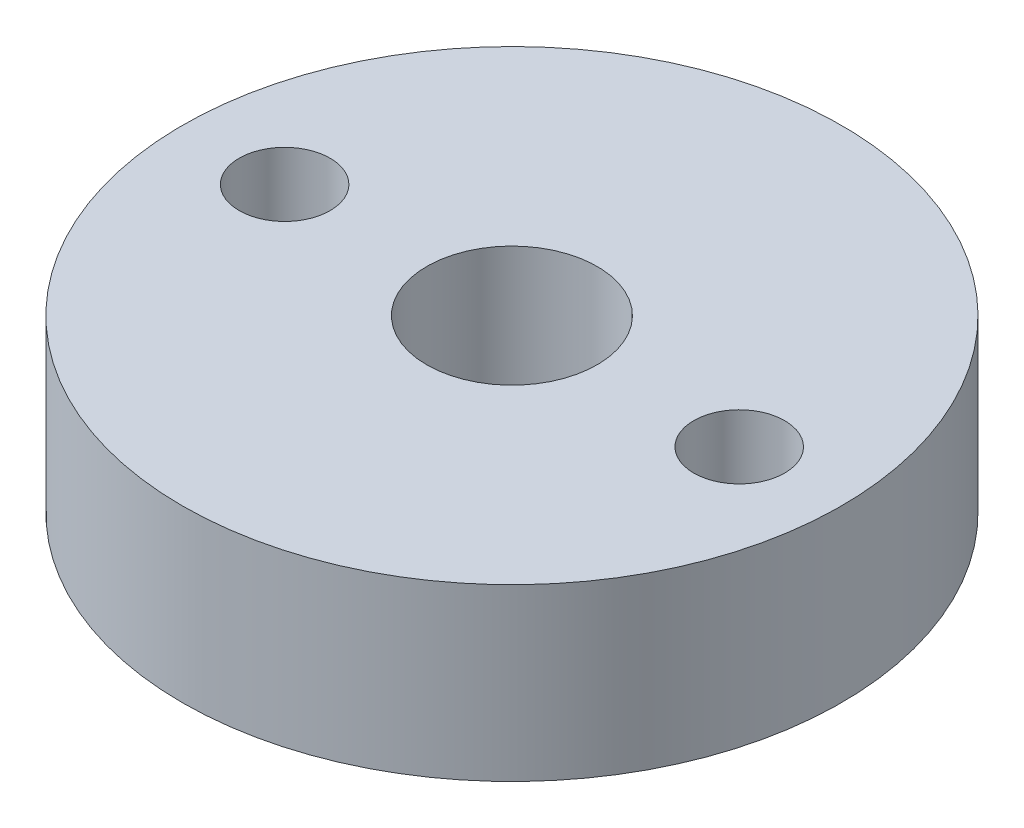
ISO-10303-21;
HEADER;
FILE_DESCRIPTION(('STEP AP214'),'2;1');
FILE_NAME('part.step','',(''),(''),'','','');
FILE_SCHEMA(('AUTOMOTIVE_DESIGN { 1 0 10303 214 1 1 1 1 }'));
ENDSEC;
DATA;
#1=APPLICATION_CONTEXT('core data for automotive mechanical design processes');
#2=APPLICATION_PROTOCOL_DEFINITION('international standard','automotive_design',2000,#1);
#3=PRODUCT_CONTEXT('',#1,'mechanical');
#4=PRODUCT('Part','Part','',(#3));
#5=PRODUCT_RELATED_PRODUCT_CATEGORY('part','',(#4));
#6=PRODUCT_DEFINITION_FORMATION('','',#4);
#7=PRODUCT_DEFINITION_CONTEXT('part definition',#1,'design');
#8=PRODUCT_DEFINITION('design','',#6,#7);
#9=PRODUCT_DEFINITION_SHAPE('','',#8);
#10=(LENGTH_UNIT() NAMED_UNIT(*) SI_UNIT(.MILLI.,.METRE.));
#11=(NAMED_UNIT(*) PLANE_ANGLE_UNIT() SI_UNIT($,.RADIAN.));
#12=(NAMED_UNIT(*) SI_UNIT($,.STERADIAN.) SOLID_ANGLE_UNIT());
#13=UNCERTAINTY_MEASURE_WITH_UNIT(LENGTH_MEASURE(1.E-05),#10,'distance_accuracy_value','');
#14=(GEOMETRIC_REPRESENTATION_CONTEXT(3) GLOBAL_UNCERTAINTY_ASSIGNED_CONTEXT((#13)) GLOBAL_UNIT_ASSIGNED_CONTEXT((#10,
#11,#12)) REPRESENTATION_CONTEXT('',''));
#15=CARTESIAN_POINT('',(0.,0.,0.));
#16=DIRECTION('',(0.,0.,1.));
#17=DIRECTION('',(1.,0.,0.));
#18=AXIS2_PLACEMENT_3D('',#15,#16,#17);
#19=CARTESIAN_POINT('',(0.,0.,0.));
#20=DIRECTION('',(0.,-1.,0.));
#21=DIRECTION('',(0.,0.,-1.));
#22=AXIS2_PLACEMENT_3D('',#19,#20,#21);
#23=CYLINDRICAL_SURFACE('',#22,11.6);
#24=CARTESIAN_POINT('',(0.,0.,0.));
#25=DIRECTION('',(0.,-1.,0.));
#26=DIRECTION('',(0.,0.,1.));
#27=AXIS2_PLACEMENT_3D('',#24,#25,#26);
#28=CIRCLE('',#27,11.6);
#29=CARTESIAN_POINT('',(0.,0.,11.6));
#30=VERTEX_POINT('',#29);
#31=EDGE_CURVE('E10',#30,#30,#28,.T.);
#32=ORIENTED_EDGE('',*,*,#31,.T.);
#33=EDGE_LOOP('',(#32));
#34=FACE_BOUND('',#33,.T.);
#35=CARTESIAN_POINT('',(0.,-6.,0.));
#36=DIRECTION('',(0.,-1.,0.));
#37=DIRECTION('',(0.,0.,1.));
#38=AXIS2_PLACEMENT_3D('',#35,#36,#37);
#39=CIRCLE('',#38,11.6);
#40=CARTESIAN_POINT('',(0.,-6.,11.6));
#41=VERTEX_POINT('',#40);
#42=EDGE_CURVE('E38',#41,#41,#39,.T.);
#43=ORIENTED_EDGE('',*,*,#42,.F.);
#44=EDGE_LOOP('',(#43));
#45=FACE_BOUND('',#44,.T.);
#46=ADVANCED_FACE('F35',(#34,#45),#23,.T.);
#47=CARTESIAN_POINT('',(0.,0.,0.));
#48=DIRECTION('',(0.,1.,0.));
#49=DIRECTION('',(0.,0.,1.));
#50=AXIS2_PLACEMENT_3D('',#47,#48,#49);
#51=PLANE('',#50);
#52=CARTESIAN_POINT('',(-8.,0.,0.));
#53=DIRECTION('',(0.,-1.,0.));
#54=DIRECTION('',(0.,0.,1.));
#55=AXIS2_PLACEMENT_3D('',#52,#53,#54);
#56=CIRCLE('',#55,1.6);
#57=CARTESIAN_POINT('',(-8.,0.,1.6));
#58=VERTEX_POINT('',#57);
#59=EDGE_CURVE('E56',#58,#58,#56,.T.);
#60=ORIENTED_EDGE('',*,*,#59,.T.);
#61=EDGE_LOOP('',(#60));
#62=FACE_BOUND('',#61,.T.);
#63=CARTESIAN_POINT('',(0.,0.,0.));
#64=DIRECTION('',(0.,-1.,0.));
#65=DIRECTION('',(0.,0.,1.));
#66=AXIS2_PLACEMENT_3D('',#63,#64,#65);
#67=CIRCLE('',#66,3.);
#68=CARTESIAN_POINT('',(0.,0.,3.));
#69=VERTEX_POINT('',#68);
#70=EDGE_CURVE('E50',#69,#69,#67,.T.);
#71=ORIENTED_EDGE('',*,*,#70,.T.);
#72=EDGE_LOOP('',(#71));
#73=FACE_BOUND('',#72,.T.);
#74=CARTESIAN_POINT('',(8.,0.,0.));
#75=DIRECTION('',(0.,-1.,0.));
#76=DIRECTION('',(0.,0.,1.));
#77=AXIS2_PLACEMENT_3D('',#74,#75,#76);
#78=CIRCLE('',#77,1.6);
#79=CARTESIAN_POINT('',(8.,0.,1.6));
#80=VERTEX_POINT('',#79);
#81=EDGE_CURVE('E45',#80,#80,#78,.T.);
#82=ORIENTED_EDGE('',*,*,#81,.T.);
#83=EDGE_LOOP('',(#82));
#84=FACE_BOUND('',#83,.T.);
#85=ORIENTED_EDGE('',*,*,#31,.F.);
#86=EDGE_LOOP('',(#85));
#87=FACE_BOUND('',#86,.T.);
#88=ADVANCED_FACE('F65',(#62,#73,#84,#87),#51,.T.);
#89=CARTESIAN_POINT('',(0.,-6.,0.));
#90=DIRECTION('',(0.,1.,0.));
#91=DIRECTION('',(0.,0.,1.));
#92=AXIS2_PLACEMENT_3D('',#89,#90,#91);
#93=PLANE('',#92);
#94=CARTESIAN_POINT('',(-8.,-6.,0.));
#95=DIRECTION('',(0.,-1.,0.));
#96=DIRECTION('',(0.,0.,1.));
#97=AXIS2_PLACEMENT_3D('',#94,#95,#96);
#98=CIRCLE('',#97,1.6);
#99=CARTESIAN_POINT('',(-8.,-6.,1.6));
#100=VERTEX_POINT('',#99);
#101=EDGE_CURVE('E59',#100,#100,#98,.T.);
#102=ORIENTED_EDGE('',*,*,#101,.F.);
#103=EDGE_LOOP('',(#102));
#104=FACE_BOUND('',#103,.T.);
#105=CARTESIAN_POINT('',(0.,-6.,0.));
#106=DIRECTION('',(0.,-1.,0.));
#107=DIRECTION('',(0.,0.,1.));
#108=AXIS2_PLACEMENT_3D('',#105,#106,#107);
#109=CIRCLE('',#108,3.);
#110=CARTESIAN_POINT('',(0.,-6.,3.));
#111=VERTEX_POINT('',#110);
#112=EDGE_CURVE('E53',#111,#111,#109,.T.);
#113=ORIENTED_EDGE('',*,*,#112,.F.);
#114=EDGE_LOOP('',(#113));
#115=FACE_BOUND('',#114,.T.);
#116=CARTESIAN_POINT('',(8.,-6.,0.));
#117=DIRECTION('',(0.,-1.,0.));
#118=DIRECTION('',(0.,0.,1.));
#119=AXIS2_PLACEMENT_3D('',#116,#117,#118);
#120=CIRCLE('',#119,1.6);
#121=CARTESIAN_POINT('',(8.,-6.,1.6));
#122=VERTEX_POINT('',#121);
#123=EDGE_CURVE('E47',#122,#122,#120,.T.);
#124=ORIENTED_EDGE('',*,*,#123,.F.);
#125=EDGE_LOOP('',(#124));
#126=FACE_BOUND('',#125,.T.);
#127=ORIENTED_EDGE('',*,*,#42,.T.);
#128=EDGE_LOOP('',(#127));
#129=FACE_BOUND('',#128,.T.);
#130=ADVANCED_FACE('F75',(#104,#115,#126,#129),#93,.F.);
#131=CARTESIAN_POINT('',(8.,0.,0.));
#132=DIRECTION('',(0.,-1.,0.));
#133=DIRECTION('',(0.,0.,-1.));
#134=AXIS2_PLACEMENT_3D('',#131,#132,#133);
#135=CYLINDRICAL_SURFACE('',#134,1.6);
#136=ORIENTED_EDGE('',*,*,#81,.F.);
#137=EDGE_LOOP('',(#136));
#138=FACE_BOUND('',#137,.T.);
#139=ORIENTED_EDGE('',*,*,#123,.T.);
#140=EDGE_LOOP('',(#139));
#141=FACE_BOUND('',#140,.T.);
#142=ADVANCED_FACE('F78',(#138,#141),#135,.F.);
#143=CARTESIAN_POINT('',(0.,0.,0.));
#144=DIRECTION('',(0.,-1.,0.));
#145=DIRECTION('',(0.,0.,-1.));
#146=AXIS2_PLACEMENT_3D('',#143,#144,#145);
#147=CYLINDRICAL_SURFACE('',#146,3.);
#148=ORIENTED_EDGE('',*,*,#70,.F.);
#149=EDGE_LOOP('',(#148));
#150=FACE_BOUND('',#149,.T.);
#151=ORIENTED_EDGE('',*,*,#112,.T.);
#152=EDGE_LOOP('',(#151));
#153=FACE_BOUND('',#152,.T.);
#154=ADVANCED_FACE('F71',(#150,#153),#147,.F.);
#155=CARTESIAN_POINT('',(-8.,0.,0.));
#156=DIRECTION('',(0.,-1.,0.));
#157=DIRECTION('',(0.,0.,-1.));
#158=AXIS2_PLACEMENT_3D('',#155,#156,#157);
#159=CYLINDRICAL_SURFACE('',#158,1.6);
#160=ORIENTED_EDGE('',*,*,#59,.F.);
#161=EDGE_LOOP('',(#160));
#162=FACE_BOUND('',#161,.T.);
#163=ORIENTED_EDGE('',*,*,#101,.T.);
#164=EDGE_LOOP('',(#163));
#165=FACE_BOUND('',#164,.T.);
#166=ADVANCED_FACE('F68',(#162,#165),#159,.F.);
#167=CLOSED_SHELL('',(#46,#88,#130,#142,#154,#166));
#168=MANIFOLD_SOLID_BREP('B2',#167);
#169=ADVANCED_BREP_SHAPE_REPRESENTATION('',(#18,#168),#14);
#170=SHAPE_DEFINITION_REPRESENTATION(#9,#169);
ENDSEC;
END-ISO-10303-21;
